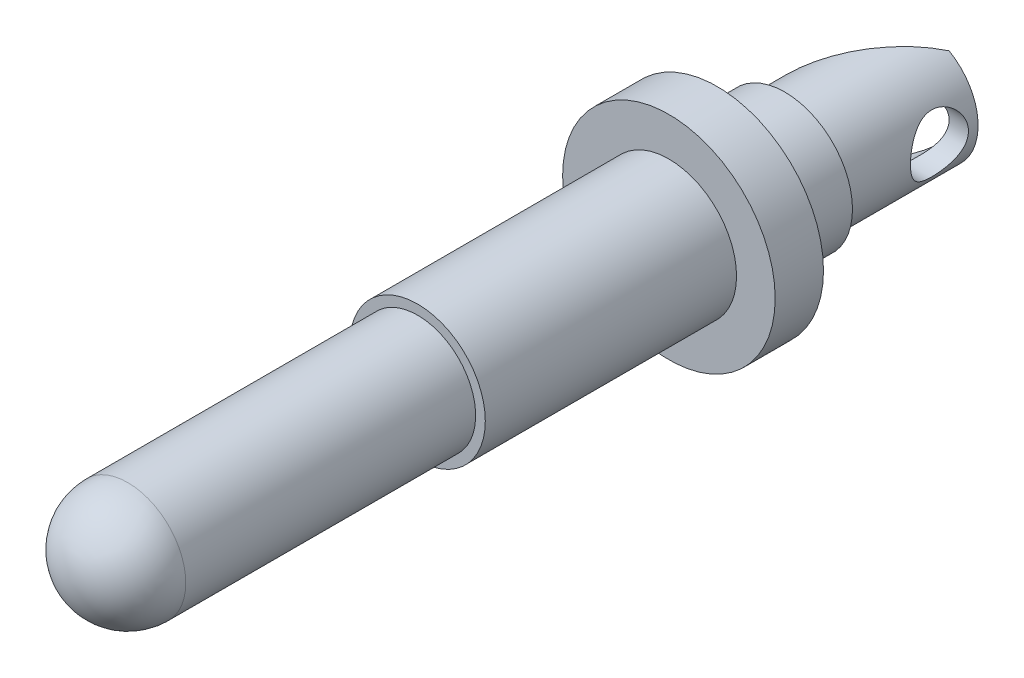
ISO-10303-21;
HEADER;
FILE_DESCRIPTION(('STEP AP214'),'2;1');
FILE_NAME('part.step','',(''),(''),'','','');
FILE_SCHEMA(('AUTOMOTIVE_DESIGN { 1 0 10303 214 1 1 1 1 }'));
ENDSEC;
DATA;
#1=APPLICATION_CONTEXT('core data for automotive mechanical design processes');
#2=APPLICATION_PROTOCOL_DEFINITION('international standard','automotive_design',2000,#1);
#3=PRODUCT_CONTEXT('',#1,'mechanical');
#4=PRODUCT('Part','Part','',(#3));
#5=PRODUCT_RELATED_PRODUCT_CATEGORY('part','',(#4));
#6=PRODUCT_DEFINITION_FORMATION('','',#4);
#7=PRODUCT_DEFINITION_CONTEXT('part definition',#1,'design');
#8=PRODUCT_DEFINITION('design','',#6,#7);
#9=PRODUCT_DEFINITION_SHAPE('','',#8);
#10=(LENGTH_UNIT() NAMED_UNIT(*) SI_UNIT(.MILLI.,.METRE.));
#11=(NAMED_UNIT(*) PLANE_ANGLE_UNIT() SI_UNIT($,.RADIAN.));
#12=(NAMED_UNIT(*) SI_UNIT($,.STERADIAN.) SOLID_ANGLE_UNIT());
#13=UNCERTAINTY_MEASURE_WITH_UNIT(LENGTH_MEASURE(1.E-05),#10,'distance_accuracy_value','');
#14=(GEOMETRIC_REPRESENTATION_CONTEXT(3) GLOBAL_UNCERTAINTY_ASSIGNED_CONTEXT((#13)) GLOBAL_UNIT_ASSIGNED_CONTEXT((#10,
#11,#12)) REPRESENTATION_CONTEXT('',''));
#15=CARTESIAN_POINT('',(0.,0.,0.));
#16=DIRECTION('',(0.,0.,1.));
#17=DIRECTION('',(1.,0.,0.));
#18=AXIS2_PLACEMENT_3D('',#15,#16,#17);
#19=CARTESIAN_POINT('',(0.,0.,-26.));
#20=DIRECTION('',(0.,0.,1.));
#21=DIRECTION('',(1.,0.,0.));
#22=AXIS2_PLACEMENT_3D('',#19,#20,#21);
#23=CYLINDRICAL_SURFACE('',#22,3.5);
#24=CARTESIAN_POINT('',(0.,0.,-19.));
#25=DIRECTION('',(0.,0.,-1.));
#26=DIRECTION('',(-1.,0.,0.));
#27=AXIS2_PLACEMENT_3D('',#24,#25,#26);
#28=CIRCLE('',#27,3.5);
#29=CARTESIAN_POINT('',(-3.5,0.,-19.));
#30=VERTEX_POINT('',#29);
#31=EDGE_CURVE('E93',#30,#30,#28,.T.);
#32=ORIENTED_EDGE('',*,*,#31,.F.);
#33=EDGE_LOOP('',(#32));
#34=FACE_BOUND('',#33,.T.);
#35=CARTESIAN_POINT('',(0.,0.,-15.5));
#36=DIRECTION('',(0.,0.,1.));
#37=DIRECTION('',(1.,0.,0.));
#38=AXIS2_PLACEMENT_3D('',#35,#36,#37);
#39=CIRCLE('',#38,3.5);
#40=CARTESIAN_POINT('',(3.5,0.,-15.5));
#41=VERTEX_POINT('',#40);
#42=EDGE_CURVE('E54',#41,#41,#39,.T.);
#43=ORIENTED_EDGE('',*,*,#42,.F.);
#44=EDGE_LOOP('',(#43));
#45=FACE_BOUND('',#44,.T.);
#46=ADVANCED_FACE('F46',(#34,#45),#23,.T.);
#47=CARTESIAN_POINT('',(0.,0.,-19.));
#48=DIRECTION('',(0.,0.,-1.));
#49=DIRECTION('',(-1.,0.,0.));
#50=AXIS2_PLACEMENT_3D('',#47,#48,#49);
#51=PLANE('',#50);
#52=CARTESIAN_POINT('',(0.,0.,-19.));
#53=DIRECTION('',(0.,0.,-1.));
#54=DIRECTION('',(-1.,0.,0.));
#55=AXIS2_PLACEMENT_3D('',#52,#53,#54);
#56=CIRCLE('',#55,3.);
#57=CARTESIAN_POINT('',(-3.,0.,-19.));
#58=VERTEX_POINT('',#57);
#59=EDGE_CURVE('E89',#58,#58,#56,.T.);
#60=ORIENTED_EDGE('',*,*,#59,.F.);
#61=EDGE_LOOP('',(#60));
#62=FACE_BOUND('',#61,.T.);
#63=ORIENTED_EDGE('',*,*,#31,.T.);
#64=EDGE_LOOP('',(#63));
#65=FACE_BOUND('',#64,.T.);
#66=ADVANCED_FACE('F161',(#62,#65),#51,.T.);
#67=CARTESIAN_POINT('',(0.,0.,-19.));
#68=DIRECTION('',(0.,0.,-1.));
#69=DIRECTION('',(-1.,0.,0.));
#70=AXIS2_PLACEMENT_3D('',#67,#68,#69);
#71=CYLINDRICAL_SURFACE('',#70,3.);
#72=CARTESIAN_POINT('',(0.,0.,-24.));
#73=DIRECTION('',(0.8,0.,0.6));
#74=DIRECTION('',(0.6,0.,-0.8));
#75=AXIS2_PLACEMENT_3D('',#72,#73,#74);
#76=ELLIPSE('',#75,5.,3.);
#77=CARTESIAN_POINT('',(1.5,-2.59807621135332,-26.));
#78=VERTEX_POINT('',#77);
#79=CARTESIAN_POINT('',(1.5,2.59807621135332,-26.));
#80=VERTEX_POINT('',#79);
#81=EDGE_CURVE('E75',#78,#80,#76,.F.);
#82=ORIENTED_EDGE('',*,*,#81,.F.);
#83=CARTESIAN_POINT('',(0.,0.,-26.));
#84=DIRECTION('',(0.,0.,-1.));
#85=DIRECTION('',(-1.,0.,0.));
#86=AXIS2_PLACEMENT_3D('',#83,#84,#85);
#87=CIRCLE('',#86,3.);
#88=EDGE_CURVE('E85',#80,#78,#87,.T.);
#89=ORIENTED_EDGE('',*,*,#88,.F.);
#90=EDGE_LOOP('',(#82,#89));
#91=FACE_BOUND('',#90,.T.);
#92=CARTESIAN_POINT('',(3.,0.,-22.5));
#93=CARTESIAN_POINT('',(2.99999570107562,-0.0788579444268496,-22.5000049534758));
#94=CARTESIAN_POINT('',(2.99685736529635,-0.157809899546343,-22.5062551096816));
#95=CARTESIAN_POINT('',(2.98461234055736,-0.313380352903342,-22.5309793205123));
#96=CARTESIAN_POINT('',(2.97549431743379,-0.389994130070442,-22.5494765894967));
#97=CARTESIAN_POINT('',(2.95224419105063,-0.538400317320669,-22.597790712925));
#98=CARTESIAN_POINT('',(2.93813158766306,-0.610210204408714,-22.627563576372));
#99=CARTESIAN_POINT('',(2.90618664773642,-0.747708925209891,-22.6973559320475));
#100=CARTESIAN_POINT('',(2.88835460450288,-0.813398240985082,-22.7373746163733));
#101=CARTESIAN_POINT('',(2.84934387387093,-0.941261726642856,-22.8292758742279));
#102=CARTESIAN_POINT('',(2.82802798691306,-1.00298281668316,-22.8817297188595));
#103=CARTESIAN_POINT('',(2.78489955370115,-1.11716916730046,-22.9957822188706));
#104=CARTESIAN_POINT('',(2.76308664313552,-1.16962737466014,-23.0573877776587));
#105=CARTESIAN_POINT('',(2.71948426796022,-1.26787800067541,-23.1937250242851));
#106=CARTESIAN_POINT('',(2.69782780455198,-1.31283800332745,-23.2691041475189));
#107=CARTESIAN_POINT('',(2.65928968158481,-1.38925234033603,-23.4275510039793));
#108=CARTESIAN_POINT('',(2.64240461410485,-1.42071632244949,-23.5106131930841));
#109=CARTESIAN_POINT('',(2.61686800556713,-1.46719866328287,-23.6769976581329));
#110=CARTESIAN_POINT('',(2.60778407375571,-1.48308878562065,-23.7600066781011));
#111=CARTESIAN_POINT('',(2.59772834922792,-1.50064048996326,-23.9279682566692));
#112=CARTESIAN_POINT('',(2.59674854014933,-1.5023161325596,-24.0129188113067));
#113=CARTESIAN_POINT('',(2.60266395385873,-1.49203093075843,-24.1714290364731));
#114=CARTESIAN_POINT('',(2.60863145493021,-1.48167683930522,-24.2451360468346));
#115=CARTESIAN_POINT('',(2.62614343100776,-1.45040977358539,-24.3895828640596));
#116=CARTESIAN_POINT('',(2.63768968247665,-1.42949343584647,-24.460321717958));
#117=CARTESIAN_POINT('',(2.66531214619112,-1.37731467057899,-24.5988436988485));
#118=CARTESIAN_POINT('',(2.68148760995998,-1.34582260067398,-24.6665195981787));
#119=CARTESIAN_POINT('',(2.71655106422106,-1.27356253150199,-24.795951438885));
#120=CARTESIAN_POINT('',(2.73544027170286,-1.23279036571869,-24.8577047034001));
#121=CARTESIAN_POINT('',(2.77669736854929,-1.13709908236917,-24.9817818791148));
#122=CARTESIAN_POINT('',(2.7992026535512,-1.08104168755391,-25.0431853103642));
#123=CARTESIAN_POINT('',(2.84321434950611,-0.95933336811205,-25.1561031278863));
#124=CARTESIAN_POINT('',(2.86472027938202,-0.893677884861418,-25.2076127880508));
#125=CARTESIAN_POINT('',(2.90552980924446,-0.750774758747763,-25.3015284915446));
#126=CARTESIAN_POINT('',(2.92468476243011,-0.673130387399105,-25.3434007086686));
#127=CARTESIAN_POINT('',(2.95736821681864,-0.510699323233188,-25.4131455435645));
#128=CARTESIAN_POINT('',(2.9709011841533,-0.425918364397907,-25.4410292775227));
#129=CARTESIAN_POINT('',(2.98986500612153,-0.259149737491048,-25.479713105575));
#130=CARTESIAN_POINT('',(2.99587407451965,-0.177512295822485,-25.4917368536202));
#131=CARTESIAN_POINT('',(3.00109520188655,-0.0131693999240255,-25.5021970967017));
#132=CARTESIAN_POINT('',(3.00031048081978,0.0695355298048641,-25.5006400284592));
#133=CARTESIAN_POINT('',(2.99236788380152,0.22684945797898,-25.4846899673719));
#134=CARTESIAN_POINT('',(2.98570868532253,0.301589112074895,-25.471301200905));
#135=CARTESIAN_POINT('',(2.9673325697226,0.447610338452911,-25.4336428921573));
#136=CARTESIAN_POINT('',(2.95561509501618,0.518891528536629,-25.4093721503198));
#137=CARTESIAN_POINT('',(2.92776377120382,0.658332912674356,-25.3500023003504));
#138=CARTESIAN_POINT('',(2.91151322654446,0.726345595508702,-25.3146134248256));
#139=CARTESIAN_POINT('',(2.87615961476127,0.855692042548903,-25.2343386965301));
#140=CARTESIAN_POINT('',(2.85705533350408,0.917022944664883,-25.1894487981069));
#141=CARTESIAN_POINT('',(2.81562332004297,1.03765153393382,-25.0863593620039));
#142=CARTESIAN_POINT('',(2.79316327265249,1.09615811672853,-25.0272856973323));
#143=CARTESIAN_POINT('',(2.7489358741323,1.20278448167828,-24.9001122730834));
#144=CARTESIAN_POINT('',(2.72716901100071,1.2508970785678,-24.8320063217281));
#145=CARTESIAN_POINT('',(2.68576788309735,1.33756187171852,-24.6845345187405));
#146=CARTESIAN_POINT('',(2.66628794383592,1.37553824370036,-24.6047831008583));
#147=CARTESIAN_POINT('',(2.63361108441203,1.43712423890204,-24.4387348986375));
#148=CARTESIAN_POINT('',(2.62040607332626,1.46075237380051,-24.3524467102997));
#149=CARTESIAN_POINT('',(2.60342251538704,1.4907925312003,-24.1846346656729));
#150=CARTESIAN_POINT('',(2.59886075197598,1.49863949460817,-24.1034486198471));
#151=CARTESIAN_POINT('',(2.59748031962406,1.50103373156429,-23.9408293992532));
#152=CARTESIAN_POINT('',(2.60065829439586,1.49558676993485,-23.8593963468932));
#153=CARTESIAN_POINT('',(2.61356793076616,1.47288918838995,-23.7067747476998));
#154=CARTESIAN_POINT('',(2.62264641723988,1.45681247151454,-23.6353492947829));
#155=CARTESIAN_POINT('',(2.6455652428148,1.41476303733661,-23.4962878208635));
#156=CARTESIAN_POINT('',(2.65940711354503,1.38878713673987,-23.428653026862));
#157=CARTESIAN_POINT('',(2.69142795546804,1.32572361795083,-23.2940627235202));
#158=CARTESIAN_POINT('',(2.70983583593882,1.28800670672354,-23.2274581472565));
#159=CARTESIAN_POINT('',(2.74852997452291,1.20322645745608,-23.1010881957281));
#160=CARTESIAN_POINT('',(2.76881720693417,1.15615825686233,-23.0413264042183));
#161=CARTESIAN_POINT('',(2.81193484737139,1.04730498999205,-22.922787026468));
#162=CARTESIAN_POINT('',(2.83477474959943,0.98442663449588,-22.8650113464746));
#163=CARTESIAN_POINT('',(2.87816628389896,0.849232209349785,-22.7606055248471));
#164=CARTESIAN_POINT('',(2.89871667939293,0.776911084957785,-22.7139813907951));
#165=CARTESIAN_POINT('',(2.93547014349806,0.623897395174408,-22.6331454559319));
#166=CARTESIAN_POINT('',(2.951641447409,0.543149255665086,-22.5990237461453));
#167=CARTESIAN_POINT('',(2.9775201194848,0.376113151707122,-22.5452877483639));
#168=CARTESIAN_POINT('',(2.98724585044602,0.289841699383643,-22.5256322297914));
#169=CARTESIAN_POINT('',(2.99543192870217,0.168902919736338,-22.5091538833714));
#170=CARTESIAN_POINT('',(2.99714048010376,0.135242819162344,-22.5057260387005));
#171=CARTESIAN_POINT('',(2.99942545465223,0.0677275977076359,-22.5011480017289));
#172=CARTESIAN_POINT('',(3.00000184655071,0.0338724714699419,-22.4999978722947));
#173=CARTESIAN_POINT('',(3.,0.,-22.5));
#174=B_SPLINE_CURVE_WITH_KNOTS('',3,(#92,#93,#94,#95,#96,#97,#98,#99,#100,#101,#102,#103,#104,
#105,#106,#107,#108,#109,#110,#111,#112,#113,#114,#115,#116,#117,#118,#119,#120,#121,#122,#123,
#124,#125,#126,#127,#128,#129,#130,#131,#132,#133,#134,#135,#136,#137,#138,#139,#140,#141,#142,
#143,#144,#145,#146,#147,#148,#149,#150,#151,#152,#153,#154,#155,#156,#157,#158,#159,#160,#161,
#162,#163,#164,#165,#166,#167,#168,#169,#170,#171,#172,#173),.UNSPECIFIED.,.T.,.F.,(4,2,2,2,2,2,
2,2,2,2,2,2,2,2,2,2,2,2,2,2,2,2,2,2,2,2,2,2,2,2,2,2,2,2,2,2,2,2,2,2,4),(0.,0.236436386130437,
0.473322224563792,0.709293233238441,0.945245640872344,1.19547263807712,1.44588935648104,
1.71572589646128,1.9853692184742,2.23887018210342,2.49212035993529,2.71508568613978,
2.93812205888515,3.16635360252728,3.3946878189033,3.65197412000815,3.90938301898026,
4.17874533321658,4.44789325368416,4.69474935707015,4.9414884676721,5.16910359759179,
5.39674382446393,5.63089284041843,5.86514176122504,6.12239415966623,6.37982382923142,
6.64972023242583,6.91926767918171,7.16293961254564,7.40650589797011,7.62686895373277,
7.8473029318252,8.08254685170425,8.3179134171544,8.58187864135751,8.84598575071862,
9.11196020495283,9.37717362931716,9.47872920200867,9.58028757766591),.UNSPECIFIED.);
#175=CARTESIAN_POINT('',(3.,0.,-22.5));
#176=VERTEX_POINT('',#175);
#177=EDGE_CURVE('E86',#176,#176,#174,.T.);
#178=ORIENTED_EDGE('',*,*,#177,.F.);
#179=EDGE_LOOP('',(#178));
#180=FACE_BOUND('',#179,.T.);
#181=ORIENTED_EDGE('',*,*,#59,.T.);
#182=EDGE_LOOP('',(#181));
#183=FACE_BOUND('',#182,.T.);
#184=ADVANCED_FACE('F83',(#91,#180,#183),#71,.T.);
#185=CARTESIAN_POINT('',(0.,0.,-26.));
#186=DIRECTION('',(0.,0.,-1.));
#187=DIRECTION('',(-1.,0.,0.));
#188=AXIS2_PLACEMENT_3D('',#185,#186,#187);
#189=PLANE('',#188);
#190=DIRECTION('',(0.,1.,0.));
#191=VECTOR('',#190,1.);
#192=CARTESIAN_POINT('',(1.5,-5.5,-26.));
#193=LINE('',#192,#191);
#194=CARTESIAN_POINT('',(1.5,1.32287565553229,-26.));
#195=VERTEX_POINT('',#194);
#196=EDGE_CURVE('E61',#195,#80,#193,.T.);
#197=ORIENTED_EDGE('',*,*,#196,.T.);
#198=ORIENTED_EDGE('',*,*,#88,.T.);
#199=CARTESIAN_POINT('',(1.5,-1.32287565553229,-26.));
#200=VERTEX_POINT('',#199);
#201=EDGE_CURVE('E72',#78,#200,#193,.T.);
#202=ORIENTED_EDGE('',*,*,#201,.T.);
#203=CARTESIAN_POINT('',(0.,0.,-26.));
#204=DIRECTION('',(0.,0.,-1.));
#205=DIRECTION('',(-1.,0.,0.));
#206=AXIS2_PLACEMENT_3D('',#203,#204,#205);
#207=CIRCLE('',#206,2.);
#208=EDGE_CURVE('E136',#195,#200,#207,.T.);
#209=ORIENTED_EDGE('',*,*,#208,.F.);
#210=EDGE_LOOP('',(#197,#198,#202,#209));
#211=FACE_BOUND('',#210,.T.);
#212=ADVANCED_FACE('F88',(#211),#189,.T.);
#213=CARTESIAN_POINT('',(0.,0.,-15.5));
#214=DIRECTION('',(0.,0.,1.));
#215=DIRECTION('',(1.,0.,0.));
#216=AXIS2_PLACEMENT_3D('',#213,#214,#215);
#217=PLANE('',#216);
#218=CARTESIAN_POINT('',(0.,0.,-15.5));
#219=DIRECTION('',(0.,0.,1.));
#220=DIRECTION('',(1.,0.,0.));
#221=AXIS2_PLACEMENT_3D('',#218,#219,#220);
#222=CIRCLE('',#221,5.5);
#223=CARTESIAN_POINT('',(5.5,0.,-15.5));
#224=VERTEX_POINT('',#223);
#225=EDGE_CURVE('E96',#224,#224,#222,.T.);
#226=ORIENTED_EDGE('',*,*,#225,.F.);
#227=EDGE_LOOP('',(#226));
#228=FACE_BOUND('',#227,.T.);
#229=ORIENTED_EDGE('',*,*,#42,.T.);
#230=EDGE_LOOP('',(#229));
#231=FACE_BOUND('',#230,.T.);
#232=ADVANCED_FACE('F158',(#228,#231),#217,.F.);
#233=CARTESIAN_POINT('',(0.,0.,-13.));
#234=DIRECTION('',(0.,0.,1.));
#235=DIRECTION('',(1.,0.,0.));
#236=AXIS2_PLACEMENT_3D('',#233,#234,#235);
#237=PLANE('',#236);
#238=CARTESIAN_POINT('',(0.,0.,-13.));
#239=DIRECTION('',(0.,0.,1.));
#240=DIRECTION('',(1.,0.,0.));
#241=AXIS2_PLACEMENT_3D('',#238,#239,#240);
#242=CIRCLE('',#241,5.5);
#243=CARTESIAN_POINT('',(5.5,0.,-13.));
#244=VERTEX_POINT('',#243);
#245=EDGE_CURVE('E141',#244,#244,#242,.T.);
#246=ORIENTED_EDGE('',*,*,#245,.T.);
#247=EDGE_LOOP('',(#246));
#248=FACE_BOUND('',#247,.T.);
#249=CARTESIAN_POINT('',(0.,0.,-13.));
#250=DIRECTION('',(0.,0.,1.));
#251=DIRECTION('',(1.,0.,0.));
#252=AXIS2_PLACEMENT_3D('',#249,#250,#251);
#253=CIRCLE('',#252,3.5);
#254=CARTESIAN_POINT('',(3.5,0.,-13.));
#255=VERTEX_POINT('',#254);
#256=EDGE_CURVE('E90',#255,#255,#253,.T.);
#257=ORIENTED_EDGE('',*,*,#256,.F.);
#258=EDGE_LOOP('',(#257));
#259=FACE_BOUND('',#258,.T.);
#260=ADVANCED_FACE('F146',(#248,#259),#237,.T.);
#261=CARTESIAN_POINT('',(0.,0.,-15.5));
#262=DIRECTION('',(0.,0.,1.));
#263=DIRECTION('',(1.,0.,0.));
#264=AXIS2_PLACEMENT_3D('',#261,#262,#263);
#265=CYLINDRICAL_SURFACE('',#264,5.5);
#266=ORIENTED_EDGE('',*,*,#225,.T.);
#267=EDGE_LOOP('',(#266));
#268=FACE_BOUND('',#267,.T.);
#269=ORIENTED_EDGE('',*,*,#245,.F.);
#270=EDGE_LOOP('',(#269));
#271=FACE_BOUND('',#270,.T.);
#272=ADVANCED_FACE('F149',(#268,#271),#265,.T.);
#273=CARTESIAN_POINT('',(0.,0.,15.));
#274=DIRECTION('',(0.,0.,1.));
#275=DIRECTION('',(1.,0.,0.));
#276=AXIS2_PLACEMENT_3D('',#273,#274,#275);
#277=SPHERICAL_SURFACE('',#276,3.);
#278=CARTESIAN_POINT('',(0.,0.,15.));
#279=DIRECTION('',(0.,0.,1.));
#280=DIRECTION('',(1.,0.,0.));
#281=AXIS2_PLACEMENT_3D('',#278,#279,#280);
#282=CIRCLE('',#281,3.);
#283=CARTESIAN_POINT('',(3.,0.,15.));
#284=VERTEX_POINT('',#283);
#285=EDGE_CURVE('E108',#284,#284,#282,.T.);
#286=ORIENTED_EDGE('',*,*,#285,.T.);
#287=EDGE_LOOP('',(#286));
#288=FACE_BOUND('',#287,.T.);
#289=ADVANCED_FACE('F48',(#288),#277,.T.);
#290=CARTESIAN_POINT('',(0.,0.,15.));
#291=DIRECTION('',(0.,0.,-1.));
#292=DIRECTION('',(-1.,0.,0.));
#293=AXIS2_PLACEMENT_3D('',#290,#291,#292);
#294=CYLINDRICAL_SURFACE('',#293,3.);
#295=ORIENTED_EDGE('',*,*,#285,.F.);
#296=EDGE_LOOP('',(#295));
#297=FACE_BOUND('',#296,.T.);
#298=CARTESIAN_POINT('',(0.,0.,0.));
#299=DIRECTION('',(0.,0.,-1.));
#300=DIRECTION('',(-1.,0.,0.));
#301=AXIS2_PLACEMENT_3D('',#298,#299,#300);
#302=CIRCLE('',#301,3.);
#303=CARTESIAN_POINT('',(-3.,0.,0.));
#304=VERTEX_POINT('',#303);
#305=EDGE_CURVE('E105',#304,#304,#302,.T.);
#306=ORIENTED_EDGE('',*,*,#305,.F.);
#307=EDGE_LOOP('',(#306));
#308=FACE_BOUND('',#307,.T.);
#309=ADVANCED_FACE('F156',(#297,#308),#294,.T.);
#310=CARTESIAN_POINT('',(0.,0.,0.));
#311=DIRECTION('',(0.,0.,-1.));
#312=DIRECTION('',(-1.,0.,0.));
#313=AXIS2_PLACEMENT_3D('',#310,#311,#312);
#314=PLANE('',#313);
#315=CARTESIAN_POINT('',(0.,0.,0.));
#316=DIRECTION('',(0.,0.,-1.));
#317=DIRECTION('',(-1.,0.,0.));
#318=AXIS2_PLACEMENT_3D('',#315,#316,#317);
#319=CIRCLE('',#318,3.5);
#320=CARTESIAN_POINT('',(-3.5,0.,0.));
#321=VERTEX_POINT('',#320);
#322=EDGE_CURVE('E102',#321,#321,#319,.T.);
#323=ORIENTED_EDGE('',*,*,#322,.F.);
#324=EDGE_LOOP('',(#323));
#325=FACE_BOUND('',#324,.T.);
#326=ORIENTED_EDGE('',*,*,#305,.T.);
#327=EDGE_LOOP('',(#326));
#328=FACE_BOUND('',#327,.T.);
#329=ADVANCED_FACE('F174',(#325,#328),#314,.F.);
#330=ORIENTED_EDGE('',*,*,#256,.T.);
#331=EDGE_LOOP('',(#330));
#332=FACE_BOUND('',#331,.T.);
#333=ORIENTED_EDGE('',*,*,#322,.T.);
#334=EDGE_LOOP('',(#333));
#335=FACE_BOUND('',#334,.T.);
#336=ADVANCED_FACE('F164',(#332,#335),#23,.T.);
#337=CARTESIAN_POINT('',(0.,0.,-18.5));
#338=DIRECTION('',(0.,0.,-1.));
#339=DIRECTION('',(-1.,0.,0.));
#340=AXIS2_PLACEMENT_3D('',#337,#338,#339);
#341=CONICAL_SURFACE('',#340,2.,1.02974425867665);
#342=CARTESIAN_POINT('',(0.,0.,-17.2982787619449));
#343=VERTEX_POINT('',#342);
#344=VERTEX_LOOP('',#343);
#345=FACE_BOUND('',#344,.T.);
#346=CARTESIAN_POINT('',(0.,0.,-18.5));
#347=DIRECTION('',(0.,0.,-1.));
#348=DIRECTION('',(-1.,0.,0.));
#349=AXIS2_PLACEMENT_3D('',#346,#347,#348);
#350=CIRCLE('',#349,2.);
#351=CARTESIAN_POINT('',(-2.,0.,-18.5));
#352=VERTEX_POINT('',#351);
#353=EDGE_CURVE('E138',#352,#352,#350,.T.);
#354=ORIENTED_EDGE('',*,*,#353,.T.);
#355=EDGE_LOOP('',(#354));
#356=FACE_BOUND('',#355,.T.);
#357=ADVANCED_FACE('F173',(#345,#356),#341,.F.);
#358=CARTESIAN_POINT('',(0.,0.,-26.));
#359=DIRECTION('',(0.,0.,-1.));
#360=DIRECTION('',(-1.,0.,0.));
#361=AXIS2_PLACEMENT_3D('',#358,#359,#360);
#362=CYLINDRICAL_SURFACE('',#361,2.);
#363=CARTESIAN_POINT('',(2.,0.,-22.5));
#364=CARTESIAN_POINT('',(1.99999540196395,-0.0732207358411537,-22.500004792012));
#365=CARTESIAN_POINT('',(1.99593645526274,-0.146561062021484,-22.5054050243745));
#366=CARTESIAN_POINT('',(1.98006607281083,-0.290936396286465,-22.5266670634102));
#367=CARTESIAN_POINT('',(1.96823514679854,-0.361965136229002,-22.5425551716501));
#368=CARTESIAN_POINT('',(1.9379567495606,-0.499234626631246,-22.5837129092838));
#369=CARTESIAN_POINT('',(1.91954951932009,-0.565501615403733,-22.6089255135692));
#370=CARTESIAN_POINT('',(1.87750556721694,-0.692422335520748,-22.6675423441872));
#371=CARTESIAN_POINT('',(1.85387037535483,-0.753077701796327,-22.7009441741935));
#372=CARTESIAN_POINT('',(1.80049544543983,-0.873465937590138,-22.7782630115908));
#373=CARTESIAN_POINT('',(1.7703930854844,-0.932593229272025,-22.8228673293341));
#374=CARTESIAN_POINT('',(1.70767017883378,-1.0430271676767,-22.9194958373612));
#375=CARTESIAN_POINT('',(1.67504578078609,-1.09432148272225,-22.9715314827998));
#376=CARTESIAN_POINT('',(1.60271123651991,-1.19837161436622,-23.0935829532784));
#377=CARTESIAN_POINT('',(1.56290854864639,-1.24930578421203,-23.1651036771217));
#378=CARTESIAN_POINT('',(1.48711444664135,-1.33861998176347,-23.3174510123666));
#379=CARTESIAN_POINT('',(1.45111786883676,-1.37701716983076,-23.3982646970003));
#380=CARTESIAN_POINT('',(1.39977155180179,-1.42880627811787,-23.5395028386762));
#381=CARTESIAN_POINT('',(1.38157751186734,-1.44625674456538,-23.5973906971284));
#382=CARTESIAN_POINT('',(1.35171594150686,-1.47420672564843,-23.7163927347849));
#383=CARTESIAN_POINT('',(1.34003347910833,-1.48472215355266,-23.7774991778748));
#384=CARTESIAN_POINT('',(1.32503759684554,-1.49812822141444,-23.9021825855308));
#385=CARTESIAN_POINT('',(1.32180026676598,-1.50094954854206,-23.9657768067241));
#386=CARTESIAN_POINT('',(1.32459531776069,-1.49848213241867,-24.0926149108816));
#387=CARTESIAN_POINT('',(1.33063102218115,-1.49319048157348,-24.1558586600874));
#388=CARTESIAN_POINT('',(1.3496762326252,-1.47597739291881,-24.2731913474258));
#389=CARTESIAN_POINT('',(1.36187157059872,-1.46482486380815,-24.3275363710462));
#390=CARTESIAN_POINT('',(1.39114192844941,-1.43705671120731,-24.4334388787209));
#391=CARTESIAN_POINT('',(1.4082216364077,-1.42043583681171,-24.4849936278236));
#392=CARTESIAN_POINT('',(1.45741769294308,-1.37033064172533,-24.6162563866342));
#393=CARTESIAN_POINT('',(1.49225649139234,-1.33280148493978,-24.6934004166435));
#394=CARTESIAN_POINT('',(1.56533298145197,-1.24618023314517,-24.8391965238691));
#395=CARTESIAN_POINT('',(1.60357878886111,-1.19706004255876,-24.9078273392547));
#396=CARTESIAN_POINT('',(1.68051672313146,-1.08651604102133,-25.0377533904037));
#397=CARTESIAN_POINT('',(1.71919586730241,-1.02481375526034,-25.0988206068815));
#398=CARTESIAN_POINT('',(1.79248037980974,-0.890422521709562,-25.2102636467812));
#399=CARTESIAN_POINT('',(1.82709348263761,-0.817755054293728,-25.2606599202304));
#400=CARTESIAN_POINT('',(1.88279726073644,-0.677902080454113,-25.3399807992403));
#401=CARTESIAN_POINT('',(1.90520770945009,-0.61253987018559,-25.3711845942158));
#402=CARTESIAN_POINT('',(1.94372904416948,-0.476352173202057,-25.4242248804639));
#403=CARTESIAN_POINT('',(1.95984387504352,-0.405530141063737,-25.4460672384993));
#404=CARTESIAN_POINT('',(1.9844558863599,-0.25967623248349,-25.4792533628864));
#405=CARTESIAN_POINT('',(1.99290592971749,-0.184621281405915,-25.4905321789386));
#406=CARTESIAN_POINT('',(2.00115883659445,-0.0332012397968913,-25.5015495973717));
#407=CARTESIAN_POINT('',(2.00096534845407,0.0431632843727479,-25.5012930686954));
#408=CARTESIAN_POINT('',(1.99242547175873,0.186804217329647,-25.4898891307268));
#409=CARTESIAN_POINT('',(1.98490086600401,0.254222327546154,-25.4798394631113));
#410=CARTESIAN_POINT('',(1.96351320201587,0.386110670609137,-25.4510262199921));
#411=CARTESIAN_POINT('',(1.94964879507261,0.45058027298728,-25.4322607903106));
#412=CARTESIAN_POINT('',(1.91599830683313,0.577416779689787,-25.3861124694069));
#413=CARTESIAN_POINT('',(1.89602050290193,0.639629172536156,-25.3584488185726));
#414=CARTESIAN_POINT('',(1.85166985411962,0.758518527043089,-25.2958275445744));
#415=CARTESIAN_POINT('',(1.82729640132067,0.815194721336418,-25.2608689123602));
#416=CARTESIAN_POINT('',(1.77119146886498,0.931511626319051,-25.1782167535894));
#417=CARTESIAN_POINT('',(1.73891095025036,0.990066762698715,-25.1293714605625));
#418=CARTESIAN_POINT('',(1.67238952874784,1.09871974855855,-25.0239912474116));
#419=CARTESIAN_POINT('',(1.63814438507394,1.14879830469578,-24.9674393003066));
#420=CARTESIAN_POINT('',(1.56369128291496,1.24877541075627,-24.8358501190388));
#421=CARTESIAN_POINT('',(1.523587185201,1.29683043648705,-24.7593424385077));
#422=CARTESIAN_POINT('',(1.4494059134845,1.37923235998283,-24.5966399220275));
#423=CARTESIAN_POINT('',(1.41531099570969,1.41362000515519,-24.5104748780914));
#424=CARTESIAN_POINT('',(1.37118877808583,1.45615734256767,-24.3645855511255));
#425=CARTESIAN_POINT('',(1.35695811824565,1.46931009512995,-24.3076088735976));
#426=CARTESIAN_POINT('',(1.33542056103011,1.48891522181906,-24.1912929530168));
#427=CARTESIAN_POINT('',(1.32809821220234,1.49538255199239,-24.1319592931977));
#428=CARTESIAN_POINT('',(1.3215760179221,1.50115320209063,-24.0121709201886));
#429=CARTESIAN_POINT('',(1.32241740684977,1.50042015325261,-23.9517120569904));
#430=CARTESIAN_POINT('',(1.33216448543668,1.49176883838217,-23.8319431612478));
#431=CARTESIAN_POINT('',(1.34108058157485,1.48384130024583,-23.7726347121027));
#432=CARTESIAN_POINT('',(1.36817348797774,1.45893841819721,-23.6440854285892));
#433=CARTESIAN_POINT('',(1.38794705950645,1.44036567954109,-23.5755028198672));
#434=CARTESIAN_POINT('',(1.43382963385412,1.39469627266116,-23.4434651511695));
#435=CARTESIAN_POINT('',(1.45995460146932,1.36757807297727,-23.3800235579618));
#436=CARTESIAN_POINT('',(1.52516477328826,1.29498918933639,-23.2374793695136));
#437=CARTESIAN_POINT('',(1.56560203191107,1.24641542065967,-23.1605784172442));
#438=CARTESIAN_POINT('',(1.64713510181275,1.13650718465932,-23.0168739550224));
#439=CARTESIAN_POINT('',(1.68823146954225,1.07516134758573,-22.9500795340551));
#440=CARTESIAN_POINT('',(1.76728988939796,0.939627144937847,-22.8271681577166));
#441=CARTESIAN_POINT('',(1.80522333711074,0.865337161562814,-22.7711436806228));
#442=CARTESIAN_POINT('',(1.87357289668098,0.705159098936154,-22.6727769488546));
#443=CARTESIAN_POINT('',(1.9040069159296,0.619299420401743,-22.6304020254275));
#444=CARTESIAN_POINT('',(1.94636704624049,0.464840290356401,-22.5722005790143));
#445=CARTESIAN_POINT('',(1.96110322499719,0.398553614774679,-22.5522332686238));
#446=CARTESIAN_POINT('',(1.98383739970238,0.262841610392707,-22.5215820973885));
#447=CARTESIAN_POINT('',(1.99185421210894,0.193425623834854,-22.51087230975));
#448=CARTESIAN_POINT('',(1.99745471706309,0.102963309861846,-22.5033953057857));
#449=CARTESIAN_POINT('',(1.9984076143208,0.08240694599409,-22.5021237225106));
#450=CARTESIAN_POINT('',(1.99968095423138,0.0412368896243617,-22.500425326769));
#451=CARTESIAN_POINT('',(2.00000129507253,0.0206231884283798,-22.4999986502926));
#452=CARTESIAN_POINT('',(2.,0.,-22.5));
#453=B_SPLINE_CURVE_WITH_KNOTS('',3,(#363,#364,#365,#366,#367,#368,#369,#370,#371,#372,#373,
#374,#375,#376,#377,#378,#379,#380,#381,#382,#383,#384,#385,#386,#387,#388,#389,#390,#391,#392,
#393,#394,#395,#396,#397,#398,#399,#400,#401,#402,#403,#404,#405,#406,#407,#408,#409,#410,#411,
#412,#413,#414,#415,#416,#417,#418,#419,#420,#421,#422,#423,#424,#425,#426,#427,#428,#429,#430,
#431,#432,#433,#434,#435,#436,#437,#438,#439,#440,#441,#442,#443,#444,#445,#446,#447,#448,#449,
#450,#451,#452),.UNSPECIFIED.,.T.,.F.,(4,2,2,2,2,2,2,2,2,2,2,2,2,2,2,2,2,2,2,2,2,2,2,2,2,2,2,2,
2,2,2,2,2,2,2,2,2,2,2,2,2,2,2,2,4),(0.,0.21957178657204,0.43969631942324,0.658496333573376,
0.877232398849287,1.11622431317429,1.35558868405161,1.6436001588745,1.93121574056505,
2.119995185299,2.30833993195289,2.49837587621256,2.68847994300208,2.85826890162708,
3.02822137600639,3.30449331805909,3.58144192357888,3.8653588393809,4.1487266249369,
4.37526505006388,4.60166129643116,4.82944058166897,5.05712372466611,5.26191187011992,
5.4667436018581,5.67880439483678,5.89089453977539,6.13840382081866,6.3864690898545,
6.68168596015944,6.9760159585011,7.1558916142293,7.33536399114205,7.51574333854738,
7.6963554856385,7.91639670960131,8.13699685139919,8.43412246655765,8.7315137239089,
9.03135449492647,9.33047220273161,9.54195697541627,9.75284752283253,9.81468166878705,
9.87652576630957),.UNSPECIFIED.);
#454=CARTESIAN_POINT('',(2.,0.,-22.5));
#455=VERTEX_POINT('',#454);
#456=EDGE_CURVE('E117',#455,#455,#453,.T.);
#457=ORIENTED_EDGE('',*,*,#456,.T.);
#458=EDGE_LOOP('',(#457));
#459=FACE_BOUND('',#458,.T.);
#460=ORIENTED_EDGE('',*,*,#353,.F.);
#461=EDGE_LOOP('',(#460));
#462=FACE_BOUND('',#461,.T.);
#463=ORIENTED_EDGE('',*,*,#208,.T.);
#464=CARTESIAN_POINT('',(0.,0.,-24.));
#465=DIRECTION('',(0.8,0.,0.6));
#466=DIRECTION('',(0.6,0.,-0.8));
#467=AXIS2_PLACEMENT_3D('',#464,#465,#466);
#468=ELLIPSE('',#467,3.33333333333333,2.);
#469=EDGE_CURVE('E13',#200,#195,#468,.F.);
#470=ORIENTED_EDGE('',*,*,#469,.T.);
#471=EDGE_LOOP('',(#463,#470));
#472=FACE_BOUND('',#471,.T.);
#473=ADVANCED_FACE('F126',(#459,#462,#472),#362,.F.);
#474=CARTESIAN_POINT('',(-3.,0.,-24.));
#475=DIRECTION('',(-1.,0.,0.));
#476=DIRECTION('',(0.,0.,1.));
#477=AXIS2_PLACEMENT_3D('',#474,#475,#476);
#478=CYLINDRICAL_SURFACE('',#477,1.49999999999999);
#479=ORIENTED_EDGE('',*,*,#177,.T.);
#480=EDGE_LOOP('',(#479));
#481=FACE_BOUND('',#480,.T.);
#482=ORIENTED_EDGE('',*,*,#456,.F.);
#483=EDGE_LOOP('',(#482));
#484=FACE_BOUND('',#483,.T.);
#485=ADVANCED_FACE('F121',(#481,#484),#478,.F.);
#486=CARTESIAN_POINT('',(1.5,-5.5,-26.));
#487=DIRECTION('',(0.8,0.,0.6));
#488=DIRECTION('',(0.6,0.,-0.8));
#489=AXIS2_PLACEMENT_3D('',#486,#487,#488);
#490=PLANE('',#489);
#491=ORIENTED_EDGE('',*,*,#81,.T.);
#492=ORIENTED_EDGE('',*,*,#196,.F.);
#493=ORIENTED_EDGE('',*,*,#469,.F.);
#494=ORIENTED_EDGE('',*,*,#201,.F.);
#495=EDGE_LOOP('',(#491,#492,#493,#494));
#496=FACE_BOUND('',#495,.T.);
#497=ADVANCED_FACE('F74',(#496),#490,.F.);
#498=CLOSED_SHELL('',(#46,#66,#184,#212,#232,#260,#272,#289,#309,#329,#336,#357,#473,#485,#497));
#499=MANIFOLD_SOLID_BREP('B2',#498);
#500=ADVANCED_BREP_SHAPE_REPRESENTATION('',(#18,#499),#14);
#501=SHAPE_DEFINITION_REPRESENTATION(#9,#500);
ENDSEC;
END-ISO-10303-21;
